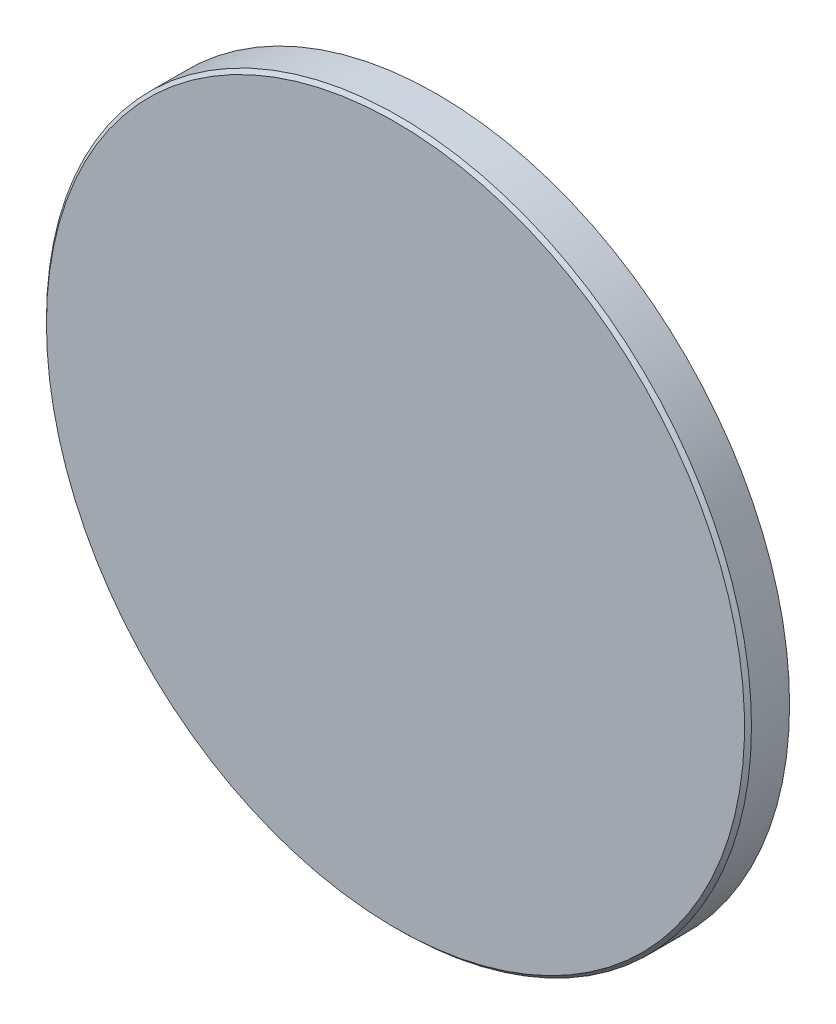
ISO-10303-21;
HEADER;
FILE_DESCRIPTION(('STEP AP214'),'2;1');
FILE_NAME('part.step','',(''),(''),'','','');
FILE_SCHEMA(('AUTOMOTIVE_DESIGN { 1 0 10303 214 1 1 1 1 }'));
ENDSEC;
DATA;
#1=APPLICATION_CONTEXT('core data for automotive mechanical design processes');
#2=APPLICATION_PROTOCOL_DEFINITION('international standard','automotive_design',2000,#1);
#3=PRODUCT_CONTEXT('',#1,'mechanical');
#4=PRODUCT('Part','Part','',(#3));
#5=PRODUCT_RELATED_PRODUCT_CATEGORY('part','',(#4));
#6=PRODUCT_DEFINITION_FORMATION('','',#4);
#7=PRODUCT_DEFINITION_CONTEXT('part definition',#1,'design');
#8=PRODUCT_DEFINITION('design','',#6,#7);
#9=PRODUCT_DEFINITION_SHAPE('','',#8);
#10=(LENGTH_UNIT() NAMED_UNIT(*) SI_UNIT(.MILLI.,.METRE.));
#11=(NAMED_UNIT(*) PLANE_ANGLE_UNIT() SI_UNIT($,.RADIAN.));
#12=(NAMED_UNIT(*) SI_UNIT($,.STERADIAN.) SOLID_ANGLE_UNIT());
#13=UNCERTAINTY_MEASURE_WITH_UNIT(LENGTH_MEASURE(1.E-05),#10,'distance_accuracy_value','');
#14=(GEOMETRIC_REPRESENTATION_CONTEXT(3) GLOBAL_UNCERTAINTY_ASSIGNED_CONTEXT((#13)) GLOBAL_UNIT_ASSIGNED_CONTEXT((#10,
#11,#12)) REPRESENTATION_CONTEXT('',''));
#15=CARTESIAN_POINT('',(0.,0.,0.));
#16=DIRECTION('',(0.,0.,1.));
#17=DIRECTION('',(1.,0.,0.));
#18=AXIS2_PLACEMENT_3D('',#15,#16,#17);
#19=CARTESIAN_POINT('',(0.,0.,0.));
#20=DIRECTION('',(0.,0.,-1.));
#21=DIRECTION('',(-1.,0.,0.));
#22=AXIS2_PLACEMENT_3D('',#19,#20,#21);
#23=PLANE('',#22);
#24=CARTESIAN_POINT('',(0.,0.,0.));
#25=DIRECTION('',(0.,0.,-1.));
#26=DIRECTION('',(-1.,0.,0.));
#27=AXIS2_PLACEMENT_3D('',#24,#25,#26);
#28=CIRCLE('',#27,25.15);
#29=CARTESIAN_POINT('',(-25.15,0.,0.));
#30=VERTEX_POINT('',#29);
#31=EDGE_CURVE('E20',#30,#30,#28,.F.);
#32=ORIENTED_EDGE('',*,*,#31,.T.);
#33=EDGE_LOOP('',(#32));
#34=FACE_BOUND('',#33,.T.);
#35=ADVANCED_FACE('F13',(#34),#23,.F.);
#36=CARTESIAN_POINT('',(0.,0.,0.));
#37=DIRECTION('',(0.,0.,1.));
#38=DIRECTION('',(1.,0.,0.));
#39=AXIS2_PLACEMENT_3D('',#36,#37,#38);
#40=CYLINDRICAL_SURFACE('',#39,25.4);
#41=CARTESIAN_POINT('',(0.,0.,-0.24999999999999));
#42=DIRECTION('',(0.,0.,-1.));
#43=DIRECTION('',(-1.,0.,0.));
#44=AXIS2_PLACEMENT_3D('',#41,#42,#43);
#45=CIRCLE('',#44,25.4);
#46=CARTESIAN_POINT('',(-25.4,0.,-0.24999999999999));
#47=VERTEX_POINT('',#46);
#48=EDGE_CURVE('E9',#47,#47,#45,.T.);
#49=ORIENTED_EDGE('',*,*,#48,.T.);
#50=EDGE_LOOP('',(#49));
#51=FACE_BOUND('',#50,.T.);
#52=CARTESIAN_POINT('',(0.,0.,-2.99581572672808));
#53=DIRECTION('',(0.,0.,1.));
#54=DIRECTION('',(1.,0.,0.));
#55=AXIS2_PLACEMENT_3D('',#52,#53,#54);
#56=CIRCLE('',#55,25.3999999999999);
#57=CARTESIAN_POINT('',(25.3999999999999,0.,-2.99581572672808));
#58=VERTEX_POINT('',#57);
#59=EDGE_CURVE('E24',#58,#58,#56,.T.);
#60=ORIENTED_EDGE('',*,*,#59,.T.);
#61=EDGE_LOOP('',(#60));
#62=FACE_BOUND('',#61,.T.);
#63=ADVANCED_FACE('F31',(#51,#62),#40,.T.);
#64=CARTESIAN_POINT('',(0.,0.,430.1));
#65=DIRECTION('',(0.,0.,1.));
#66=DIRECTION('',(0.,1.,0.));
#67=AXIS2_PLACEMENT_3D('',#64,#65,#66);
#68=SPHERICAL_SURFACE('',#67,433.84);
#69=ORIENTED_EDGE('',*,*,#59,.F.);
#70=EDGE_LOOP('',(#69));
#71=FACE_BOUND('',#70,.T.);
#72=ADVANCED_FACE('F33',(#71),#68,.T.);
#73=CARTESIAN_POINT('',(0.,0.,0.));
#74=DIRECTION('',(0.,0.,-1.));
#75=DIRECTION('',(-1.,0.,0.));
#76=AXIS2_PLACEMENT_3D('',#73,#74,#75);
#77=CONICAL_SURFACE('',#76,25.15,0.785398163397441);
#78=ORIENTED_EDGE('',*,*,#48,.F.);
#79=EDGE_LOOP('',(#78));
#80=FACE_BOUND('',#79,.T.);
#81=ORIENTED_EDGE('',*,*,#31,.F.);
#82=EDGE_LOOP('',(#81));
#83=FACE_BOUND('',#82,.T.);
#84=ADVANCED_FACE('F15',(#80,#83),#77,.T.);
#85=CLOSED_SHELL('',(#35,#63,#72,#84));
#86=MANIFOLD_SOLID_BREP('B1',#85);
#87=ADVANCED_BREP_SHAPE_REPRESENTATION('',(#18,#86),#14);
#88=SHAPE_DEFINITION_REPRESENTATION(#9,#87);
ENDSEC;
END-ISO-10303-21;
